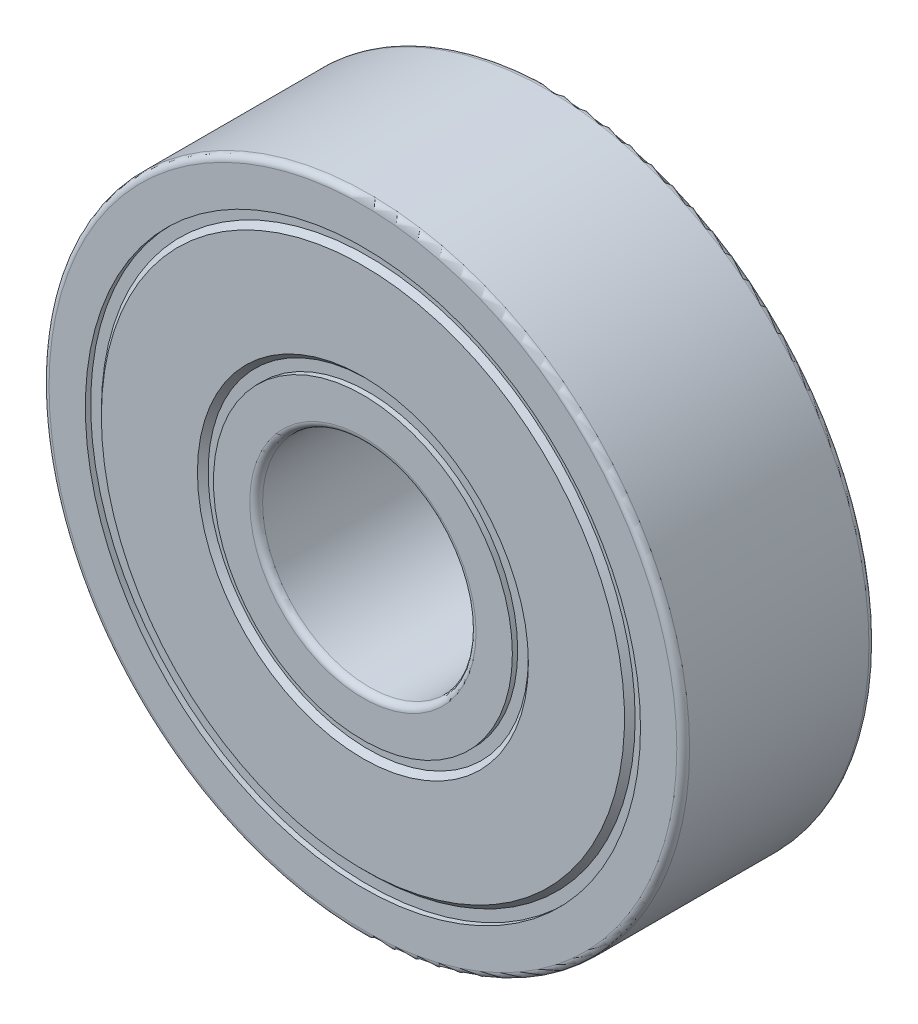
ISO-10303-21;
HEADER;
FILE_DESCRIPTION(('STEP AP214'),'2;1');
FILE_NAME('part.step','',(''),(''),'','','');
FILE_SCHEMA(('AUTOMOTIVE_DESIGN { 1 0 10303 214 1 1 1 1 }'));
ENDSEC;
DATA;
#1=APPLICATION_CONTEXT('core data for automotive mechanical design processes');
#2=APPLICATION_PROTOCOL_DEFINITION('international standard','automotive_design',2000,#1);
#3=PRODUCT_CONTEXT('',#1,'mechanical');
#4=PRODUCT('Part','Part','',(#3));
#5=PRODUCT_RELATED_PRODUCT_CATEGORY('part','',(#4));
#6=PRODUCT_DEFINITION_FORMATION('','',#4);
#7=PRODUCT_DEFINITION_CONTEXT('part definition',#1,'design');
#8=PRODUCT_DEFINITION('design','',#6,#7);
#9=PRODUCT_DEFINITION_SHAPE('','',#8);
#10=(LENGTH_UNIT() NAMED_UNIT(*) SI_UNIT(.MILLI.,.METRE.));
#11=(NAMED_UNIT(*) PLANE_ANGLE_UNIT() SI_UNIT($,.RADIAN.));
#12=(NAMED_UNIT(*) SI_UNIT($,.STERADIAN.) SOLID_ANGLE_UNIT());
#13=UNCERTAINTY_MEASURE_WITH_UNIT(LENGTH_MEASURE(1.E-05),#10,'distance_accuracy_value','');
#14=(GEOMETRIC_REPRESENTATION_CONTEXT(3) GLOBAL_UNCERTAINTY_ASSIGNED_CONTEXT((#13)) GLOBAL_UNIT_ASSIGNED_CONTEXT((#10,
#11,#12)) REPRESENTATION_CONTEXT('',''));
#15=CARTESIAN_POINT('',(0.,0.,0.));
#16=DIRECTION('',(0.,0.,1.));
#17=DIRECTION('',(1.,0.,0.));
#18=AXIS2_PLACEMENT_3D('',#15,#16,#17);
#19=CARTESIAN_POINT('',(0.,0.,0.));
#20=DIRECTION('',(0.,0.,1.));
#21=DIRECTION('',(1.,0.,0.));
#22=AXIS2_PLACEMENT_3D('',#19,#20,#21);
#23=CYLINDRICAL_SURFACE('',#22,4.99999999999999);
#24=CARTESIAN_POINT('',(0.,0.,-4.20000000000002));
#25=DIRECTION('',(0.,0.,1.));
#26=DIRECTION('',(1.,0.,0.));
#27=AXIS2_PLACEMENT_3D('',#24,#25,#26);
#28=CIRCLE('',#27,5.00000000000001);
#29=CARTESIAN_POINT('',(5.00000000000001,0.,-4.20000000000002));
#30=VERTEX_POINT('',#29);
#31=EDGE_CURVE('E64',#30,#30,#28,.T.);
#32=ORIENTED_EDGE('',*,*,#31,.F.);
#33=EDGE_LOOP('',(#32));
#34=FACE_BOUND('',#33,.T.);
#35=CARTESIAN_POINT('',(0.,0.,4.20000000000001));
#36=DIRECTION('',(0.,0.,1.));
#37=DIRECTION('',(1.,0.,0.));
#38=AXIS2_PLACEMENT_3D('',#35,#36,#37);
#39=CIRCLE('',#38,5.00000000000001);
#40=CARTESIAN_POINT('',(5.00000000000001,0.,4.20000000000002));
#41=VERTEX_POINT('',#40);
#42=EDGE_CURVE('E490',#41,#41,#39,.F.);
#43=ORIENTED_EDGE('',*,*,#42,.F.);
#44=EDGE_LOOP('',(#43));
#45=FACE_BOUND('',#44,.T.);
#46=ADVANCED_FACE('F17',(#34,#45),#23,.F.);
#47=CARTESIAN_POINT('',(0.,0.,4.20000000000002));
#48=DIRECTION('',(0.,0.,1.));
#49=DIRECTION('',(1.,0.,0.));
#50=AXIS2_PLACEMENT_3D('',#47,#48,#49);
#51=TOROIDAL_SURFACE('',#50,5.30000000000001,0.299999999999999);
#52=CARTESIAN_POINT('',(0.,0.,4.50000000000001));
#53=DIRECTION('',(0.,0.,1.));
#54=DIRECTION('',(1.,0.,0.));
#55=AXIS2_PLACEMENT_3D('',#52,#53,#54);
#56=CIRCLE('',#55,5.29999999999999);
#57=CARTESIAN_POINT('',(-5.30000000000001,0.,4.50000000000001));
#58=VERTEX_POINT('',#57);
#59=CARTESIAN_POINT('',(5.29999999999999,0.,4.50000000000001));
#60=VERTEX_POINT('',#59);
#61=EDGE_CURVE('E58',#58,#60,#56,.F.);
#62=ORIENTED_EDGE('',*,*,#61,.F.);
#63=CARTESIAN_POINT('',(0.,0.,4.50000000000001));
#64=DIRECTION('',(0.,0.,1.));
#65=DIRECTION('',(-1.,0.,0.));
#66=AXIS2_PLACEMENT_3D('',#63,#64,#65);
#67=CIRCLE('',#66,5.30000000000001);
#68=EDGE_CURVE('E55',#60,#58,#67,.F.);
#69=ORIENTED_EDGE('',*,*,#68,.F.);
#70=EDGE_LOOP('',(#62,#69));
#71=FACE_BOUND('',#70,.T.);
#72=ORIENTED_EDGE('',*,*,#42,.T.);
#73=EDGE_LOOP('',(#72));
#74=FACE_BOUND('',#73,.T.);
#75=ADVANCED_FACE('F60',(#71,#74),#51,.T.);
#76=CARTESIAN_POINT('',(0.,0.,-4.20000000000002));
#77=DIRECTION('',(0.,0.,1.));
#78=DIRECTION('',(1.,0.,0.));
#79=AXIS2_PLACEMENT_3D('',#76,#77,#78);
#80=TOROIDAL_SURFACE('',#79,5.30000000000001,0.299999999999999);
#81=ORIENTED_EDGE('',*,*,#31,.T.);
#82=EDGE_LOOP('',(#81));
#83=FACE_BOUND('',#82,.T.);
#84=CARTESIAN_POINT('',(0.,0.,-4.50000000000001));
#85=DIRECTION('',(0.,0.,-1.));
#86=DIRECTION('',(1.,0.,0.));
#87=AXIS2_PLACEMENT_3D('',#84,#85,#86);
#88=CIRCLE('',#87,5.30000000000001);
#89=CARTESIAN_POINT('',(-5.29999999999999,0.,-4.50000000000001));
#90=VERTEX_POINT('',#89);
#91=CARTESIAN_POINT('',(5.3,0.,-4.50000000000001));
#92=VERTEX_POINT('',#91);
#93=EDGE_CURVE('E70',#90,#92,#88,.F.);
#94=ORIENTED_EDGE('',*,*,#93,.F.);
#95=CARTESIAN_POINT('',(0.,0.,-4.50000000000001));
#96=DIRECTION('',(0.,0.,-1.));
#97=DIRECTION('',(-1.,0.,0.));
#98=AXIS2_PLACEMENT_3D('',#95,#96,#97);
#99=CIRCLE('',#98,5.29999999999999);
#100=EDGE_CURVE('E118',#92,#90,#99,.F.);
#101=ORIENTED_EDGE('',*,*,#100,.F.);
#102=EDGE_LOOP('',(#94,#101));
#103=FACE_BOUND('',#102,.T.);
#104=ADVANCED_FACE('F91',(#83,#103),#80,.T.);
#105=CARTESIAN_POINT('',(4.99999999999999,0.,4.50000000000001));
#106=DIRECTION('',(0.,0.,1.));
#107=DIRECTION('',(1.,0.,0.));
#108=AXIS2_PLACEMENT_3D('',#105,#106,#107);
#109=PLANE('',#108);
#110=ORIENTED_EDGE('',*,*,#61,.T.);
#111=ORIENTED_EDGE('',*,*,#68,.T.);
#112=EDGE_LOOP('',(#110,#111));
#113=FACE_BOUND('',#112,.T.);
#114=CARTESIAN_POINT('',(0.,0.,4.50000000000001));
#115=DIRECTION('',(0.,0.,1.));
#116=DIRECTION('',(1.,0.,0.));
#117=AXIS2_PLACEMENT_3D('',#114,#115,#116);
#118=CIRCLE('',#117,6.99999999999999);
#119=CARTESIAN_POINT('',(6.99999999999999,0.,4.50000000000001));
#120=VERTEX_POINT('',#119);
#121=EDGE_CURVE('E20',#120,#120,#118,.F.);
#122=ORIENTED_EDGE('',*,*,#121,.F.);
#123=EDGE_LOOP('',(#122));
#124=FACE_BOUND('',#123,.T.);
#125=ADVANCED_FACE('F68',(#113,#124),#109,.T.);
#126=CARTESIAN_POINT('',(6.99999999999999,0.,-4.50000000000001));
#127=DIRECTION('',(0.,0.,-1.));
#128=DIRECTION('',(-1.,0.,0.));
#129=AXIS2_PLACEMENT_3D('',#126,#127,#128);
#130=PLANE('',#129);
#131=ORIENTED_EDGE('',*,*,#93,.T.);
#132=ORIENTED_EDGE('',*,*,#100,.T.);
#133=EDGE_LOOP('',(#131,#132));
#134=FACE_BOUND('',#133,.T.);
#135=CARTESIAN_POINT('',(0.,0.,-4.50000000000001));
#136=DIRECTION('',(0.,0.,1.));
#137=DIRECTION('',(1.,0.,0.));
#138=AXIS2_PLACEMENT_3D('',#135,#136,#137);
#139=CIRCLE('',#138,6.99999999999999);
#140=CARTESIAN_POINT('',(6.99999999999999,0.,-4.50000000000001));
#141=VERTEX_POINT('',#140);
#142=EDGE_CURVE('E291',#141,#141,#139,.T.);
#143=ORIENTED_EDGE('',*,*,#142,.F.);
#144=EDGE_LOOP('',(#143));
#145=FACE_BOUND('',#144,.T.);
#146=ADVANCED_FACE('F90',(#134,#145),#130,.T.);
#147=CARTESIAN_POINT('',(0.,0.,4.375));
#148=DIRECTION('',(0.,0.,1.));
#149=DIRECTION('',(1.,0.,0.));
#150=AXIS2_PLACEMENT_3D('',#147,#148,#149);
#151=CYLINDRICAL_SURFACE('',#150,6.99999999999999);
#152=CARTESIAN_POINT('',(0.,0.,4.25000000000002));
#153=DIRECTION('',(0.,0.,1.));
#154=DIRECTION('',(1.,0.,0.));
#155=AXIS2_PLACEMENT_3D('',#152,#153,#154);
#156=CIRCLE('',#155,6.99999999999999);
#157=CARTESIAN_POINT('',(6.99999999999999,0.,4.25000000000002));
#158=VERTEX_POINT('',#157);
#159=EDGE_CURVE('E289',#158,#158,#156,.F.);
#160=ORIENTED_EDGE('',*,*,#159,.F.);
#161=EDGE_LOOP('',(#160));
#162=FACE_BOUND('',#161,.T.);
#163=ORIENTED_EDGE('',*,*,#121,.T.);
#164=EDGE_LOOP('',(#163));
#165=FACE_BOUND('',#164,.T.);
#166=ADVANCED_FACE('F298',(#162,#165),#151,.T.);
#167=CARTESIAN_POINT('',(0.,0.,-4.375));
#168=DIRECTION('',(0.,0.,1.));
#169=DIRECTION('',(1.,0.,0.));
#170=AXIS2_PLACEMENT_3D('',#167,#168,#169);
#171=CYLINDRICAL_SURFACE('',#170,6.99999999999999);
#172=ORIENTED_EDGE('',*,*,#142,.T.);
#173=EDGE_LOOP('',(#172));
#174=FACE_BOUND('',#173,.T.);
#175=CARTESIAN_POINT('',(0.,0.,-4.25000000000002));
#176=DIRECTION('',(0.,0.,1.));
#177=DIRECTION('',(1.,0.,0.));
#178=AXIS2_PLACEMENT_3D('',#175,#176,#177);
#179=CIRCLE('',#178,6.99999999999999);
#180=CARTESIAN_POINT('',(6.99999999999999,0.,-4.25000000000002));
#181=VERTEX_POINT('',#180);
#182=EDGE_CURVE('E286',#181,#181,#179,.T.);
#183=ORIENTED_EDGE('',*,*,#182,.F.);
#184=EDGE_LOOP('',(#183));
#185=FACE_BOUND('',#184,.T.);
#186=ADVANCED_FACE('F300',(#174,#185),#171,.T.);
#187=CARTESIAN_POINT('',(6.99999999999999,0.,4.25000000000002));
#188=DIRECTION('',(0.,0.,1.));
#189=DIRECTION('',(1.,0.,0.));
#190=AXIS2_PLACEMENT_3D('',#187,#188,#189);
#191=PLANE('',#190);
#192=ORIENTED_EDGE('',*,*,#159,.T.);
#193=EDGE_LOOP('',(#192));
#194=FACE_BOUND('',#193,.T.);
#195=CARTESIAN_POINT('',(0.,0.,4.25000000000001));
#196=DIRECTION('',(0.,0.,1.));
#197=DIRECTION('',(1.,0.,0.));
#198=AXIS2_PLACEMENT_3D('',#195,#196,#197);
#199=CIRCLE('',#198,7.50000000000001);
#200=CARTESIAN_POINT('',(7.50000000000001,0.,4.25000000000001));
#201=VERTEX_POINT('',#200);
#202=EDGE_CURVE('E283',#201,#201,#199,.T.);
#203=ORIENTED_EDGE('',*,*,#202,.T.);
#204=EDGE_LOOP('',(#203));
#205=FACE_BOUND('',#204,.T.);
#206=ADVANCED_FACE('F307',(#194,#205),#191,.T.);
#207=CARTESIAN_POINT('',(7.5,0.,-4.25000000000002));
#208=DIRECTION('',(0.,0.,-1.));
#209=DIRECTION('',(-1.,0.,0.));
#210=AXIS2_PLACEMENT_3D('',#207,#208,#209);
#211=PLANE('',#210);
#212=ORIENTED_EDGE('',*,*,#182,.T.);
#213=EDGE_LOOP('',(#212));
#214=FACE_BOUND('',#213,.T.);
#215=CARTESIAN_POINT('',(0.,0.,-4.25000000000001));
#216=DIRECTION('',(0.,0.,-1.));
#217=DIRECTION('',(-1.,0.,0.));
#218=AXIS2_PLACEMENT_3D('',#215,#216,#217);
#219=CIRCLE('',#218,7.50000000000001);
#220=CARTESIAN_POINT('',(-7.50000000000001,0.,-4.25000000000001));
#221=VERTEX_POINT('',#220);
#222=EDGE_CURVE('E280',#221,#221,#219,.T.);
#223=ORIENTED_EDGE('',*,*,#222,.T.);
#224=EDGE_LOOP('',(#223));
#225=FACE_BOUND('',#224,.T.);
#226=ADVANCED_FACE('F418',(#214,#225),#211,.T.);
#227=CARTESIAN_POINT('',(0.,0.,4.5));
#228=DIRECTION('',(0.,0.,1.));
#229=DIRECTION('',(1.,0.,0.));
#230=AXIS2_PLACEMENT_3D('',#227,#228,#229);
#231=CONICAL_SURFACE('',#230,7.75000000000001,0.78539816339746);
#232=ORIENTED_EDGE('',*,*,#202,.F.);
#233=EDGE_LOOP('',(#232));
#234=FACE_BOUND('',#233,.T.);
#235=CARTESIAN_POINT('',(0.,0.,4.49999999999999));
#236=DIRECTION('',(0.,0.,1.));
#237=DIRECTION('',(1.,0.,0.));
#238=AXIS2_PLACEMENT_3D('',#235,#236,#237);
#239=CIRCLE('',#238,7.75);
#240=CARTESIAN_POINT('',(7.75,0.,4.49999999999999));
#241=VERTEX_POINT('',#240);
#242=EDGE_CURVE('E277',#241,#241,#239,.F.);
#243=ORIENTED_EDGE('',*,*,#242,.F.);
#244=EDGE_LOOP('',(#243));
#245=FACE_BOUND('',#244,.T.);
#246=ADVANCED_FACE('F410',(#234,#245),#231,.F.);
#247=CARTESIAN_POINT('',(0.,0.,-4.5));
#248=DIRECTION('',(0.,0.,-1.));
#249=DIRECTION('',(-1.,0.,0.));
#250=AXIS2_PLACEMENT_3D('',#247,#248,#249);
#251=CONICAL_SURFACE('',#250,7.75,0.785398163397455);
#252=CARTESIAN_POINT('',(0.,0.,-4.5));
#253=DIRECTION('',(0.,0.,-1.));
#254=DIRECTION('',(-1.,0.,0.));
#255=AXIS2_PLACEMENT_3D('',#252,#253,#254);
#256=CIRCLE('',#255,7.75);
#257=CARTESIAN_POINT('',(-7.75,0.,-4.5));
#258=VERTEX_POINT('',#257);
#259=EDGE_CURVE('E274',#258,#258,#256,.F.);
#260=ORIENTED_EDGE('',*,*,#259,.F.);
#261=EDGE_LOOP('',(#260));
#262=FACE_BOUND('',#261,.T.);
#263=ORIENTED_EDGE('',*,*,#222,.F.);
#264=EDGE_LOOP('',(#263));
#265=FACE_BOUND('',#264,.T.);
#266=ADVANCED_FACE('F402',(#262,#265),#251,.F.);
#267=CARTESIAN_POINT('',(7.74999999999999,0.,4.50000000000001));
#268=DIRECTION('',(0.,0.,1.));
#269=DIRECTION('',(1.,0.,0.));
#270=AXIS2_PLACEMENT_3D('',#267,#268,#269);
#271=PLANE('',#270);
#272=ORIENTED_EDGE('',*,*,#242,.T.);
#273=EDGE_LOOP('',(#272));
#274=FACE_BOUND('',#273,.T.);
#275=CARTESIAN_POINT('',(0.,0.,4.50000000000001));
#276=DIRECTION('',(0.,0.,-1.));
#277=DIRECTION('',(-1.,0.,0.));
#278=AXIS2_PLACEMENT_3D('',#275,#276,#277);
#279=CIRCLE('',#278,12.25);
#280=CARTESIAN_POINT('',(-12.25,0.,4.5));
#281=VERTEX_POINT('',#280);
#282=EDGE_CURVE('E271',#281,#281,#279,.T.);
#283=ORIENTED_EDGE('',*,*,#282,.F.);
#284=EDGE_LOOP('',(#283));
#285=FACE_BOUND('',#284,.T.);
#286=ADVANCED_FACE('F394',(#274,#285),#271,.T.);
#287=CARTESIAN_POINT('',(12.25,0.,-4.50000000000001));
#288=DIRECTION('',(0.,0.,-1.));
#289=DIRECTION('',(-1.,0.,0.));
#290=AXIS2_PLACEMENT_3D('',#287,#288,#289);
#291=PLANE('',#290);
#292=ORIENTED_EDGE('',*,*,#259,.T.);
#293=EDGE_LOOP('',(#292));
#294=FACE_BOUND('',#293,.T.);
#295=CARTESIAN_POINT('',(0.,0.,-4.50000000000001));
#296=DIRECTION('',(0.,0.,1.));
#297=DIRECTION('',(1.,0.,0.));
#298=AXIS2_PLACEMENT_3D('',#295,#296,#297);
#299=CIRCLE('',#298,12.25);
#300=CARTESIAN_POINT('',(12.25,0.,-4.50000000000001));
#301=VERTEX_POINT('',#300);
#302=EDGE_CURVE('E268',#301,#301,#299,.T.);
#303=ORIENTED_EDGE('',*,*,#302,.F.);
#304=EDGE_LOOP('',(#303));
#305=FACE_BOUND('',#304,.T.);
#306=ADVANCED_FACE('F386',(#294,#305),#291,.T.);
#307=CARTESIAN_POINT('',(0.,0.,4.25));
#308=DIRECTION('',(0.,0.,-1.));
#309=DIRECTION('',(-1.,0.,0.));
#310=AXIS2_PLACEMENT_3D('',#307,#308,#309);
#311=CONICAL_SURFACE('',#310,12.5,0.785398163397438);
#312=CARTESIAN_POINT('',(0.,0.,4.25));
#313=DIRECTION('',(0.,0.,-1.));
#314=DIRECTION('',(-1.,0.,0.));
#315=AXIS2_PLACEMENT_3D('',#312,#313,#314);
#316=CIRCLE('',#315,12.5);
#317=CARTESIAN_POINT('',(-12.5,0.,4.25));
#318=VERTEX_POINT('',#317);
#319=EDGE_CURVE('E265',#318,#318,#316,.T.);
#320=ORIENTED_EDGE('',*,*,#319,.F.);
#321=EDGE_LOOP('',(#320));
#322=FACE_BOUND('',#321,.T.);
#323=ORIENTED_EDGE('',*,*,#282,.T.);
#324=EDGE_LOOP('',(#323));
#325=FACE_BOUND('',#324,.T.);
#326=ADVANCED_FACE('F378',(#322,#325),#311,.T.);
#327=CARTESIAN_POINT('',(0.,0.,-4.25000000000002));
#328=DIRECTION('',(0.,0.,1.));
#329=DIRECTION('',(1.,0.,0.));
#330=AXIS2_PLACEMENT_3D('',#327,#328,#329);
#331=CONICAL_SURFACE('',#330,12.5,0.78539816339744);
#332=ORIENTED_EDGE('',*,*,#302,.T.);
#333=EDGE_LOOP('',(#332));
#334=FACE_BOUND('',#333,.T.);
#335=CARTESIAN_POINT('',(0.,0.,-4.25000000000002));
#336=DIRECTION('',(0.,0.,1.));
#337=DIRECTION('',(1.,0.,0.));
#338=AXIS2_PLACEMENT_3D('',#335,#336,#337);
#339=CIRCLE('',#338,12.5);
#340=CARTESIAN_POINT('',(12.5,0.,-4.25000000000002));
#341=VERTEX_POINT('',#340);
#342=EDGE_CURVE('E262',#341,#341,#339,.T.);
#343=ORIENTED_EDGE('',*,*,#342,.F.);
#344=EDGE_LOOP('',(#343));
#345=FACE_BOUND('',#344,.T.);
#346=ADVANCED_FACE('F370',(#334,#345),#331,.T.);
#347=CARTESIAN_POINT('',(12.5,0.,4.25000000000002));
#348=DIRECTION('',(0.,0.,1.));
#349=DIRECTION('',(1.,0.,0.));
#350=AXIS2_PLACEMENT_3D('',#347,#348,#349);
#351=PLANE('',#350);
#352=ORIENTED_EDGE('',*,*,#319,.T.);
#353=EDGE_LOOP('',(#352));
#354=FACE_BOUND('',#353,.T.);
#355=CARTESIAN_POINT('',(0.,0.,4.25000000000002));
#356=DIRECTION('',(0.,0.,1.));
#357=DIRECTION('',(1.,0.,0.));
#358=AXIS2_PLACEMENT_3D('',#355,#356,#357);
#359=CIRCLE('',#358,13.);
#360=CARTESIAN_POINT('',(13.,0.,4.25000000000002));
#361=VERTEX_POINT('',#360);
#362=EDGE_CURVE('E259',#361,#361,#359,.T.);
#363=ORIENTED_EDGE('',*,*,#362,.T.);
#364=EDGE_LOOP('',(#363));
#365=FACE_BOUND('',#364,.T.);
#366=ADVANCED_FACE('F362',(#354,#365),#351,.T.);
#367=CARTESIAN_POINT('',(13.,0.,-4.25000000000002));
#368=DIRECTION('',(0.,0.,-1.));
#369=DIRECTION('',(-1.,0.,0.));
#370=AXIS2_PLACEMENT_3D('',#367,#368,#369);
#371=PLANE('',#370);
#372=ORIENTED_EDGE('',*,*,#342,.T.);
#373=EDGE_LOOP('',(#372));
#374=FACE_BOUND('',#373,.T.);
#375=CARTESIAN_POINT('',(0.,0.,-4.25000000000002));
#376=DIRECTION('',(0.,0.,1.));
#377=DIRECTION('',(1.,0.,0.));
#378=AXIS2_PLACEMENT_3D('',#375,#376,#377);
#379=CIRCLE('',#378,13.);
#380=CARTESIAN_POINT('',(13.,0.,-4.25000000000002));
#381=VERTEX_POINT('',#380);
#382=EDGE_CURVE('E252',#381,#381,#379,.F.);
#383=ORIENTED_EDGE('',*,*,#382,.T.);
#384=EDGE_LOOP('',(#383));
#385=FACE_BOUND('',#384,.T.);
#386=ADVANCED_FACE('F355',(#374,#385),#371,.T.);
#387=CARTESIAN_POINT('',(0.,0.,4.375));
#388=DIRECTION('',(0.,0.,1.));
#389=DIRECTION('',(1.,0.,0.));
#390=AXIS2_PLACEMENT_3D('',#387,#388,#389);
#391=CYLINDRICAL_SURFACE('',#390,13.);
#392=ORIENTED_EDGE('',*,*,#362,.F.);
#393=EDGE_LOOP('',(#392));
#394=FACE_BOUND('',#393,.T.);
#395=CARTESIAN_POINT('',(0.,0.,4.50000000000001));
#396=DIRECTION('',(0.,0.,1.));
#397=DIRECTION('',(1.,0.,0.));
#398=AXIS2_PLACEMENT_3D('',#395,#396,#397);
#399=CIRCLE('',#398,13.);
#400=CARTESIAN_POINT('',(13.,0.,4.50000000000001));
#401=VERTEX_POINT('',#400);
#402=EDGE_CURVE('E247',#401,#401,#399,.F.);
#403=ORIENTED_EDGE('',*,*,#402,.F.);
#404=EDGE_LOOP('',(#403));
#405=FACE_BOUND('',#404,.T.);
#406=ADVANCED_FACE('F348',(#394,#405),#391,.F.);
#407=CARTESIAN_POINT('',(0.,0.,-4.37500000000003));
#408=DIRECTION('',(0.,0.,1.));
#409=DIRECTION('',(1.,0.,0.));
#410=AXIS2_PLACEMENT_3D('',#407,#408,#409);
#411=CYLINDRICAL_SURFACE('',#410,13.);
#412=CARTESIAN_POINT('',(0.,0.,-4.50000000000001));
#413=DIRECTION('',(0.,0.,1.));
#414=DIRECTION('',(1.,0.,0.));
#415=AXIS2_PLACEMENT_3D('',#412,#413,#414);
#416=CIRCLE('',#415,13.);
#417=CARTESIAN_POINT('',(13.,0.,-4.5));
#418=VERTEX_POINT('',#417);
#419=EDGE_CURVE('E245',#418,#418,#416,.T.);
#420=ORIENTED_EDGE('',*,*,#419,.F.);
#421=EDGE_LOOP('',(#420));
#422=FACE_BOUND('',#421,.T.);
#423=ORIENTED_EDGE('',*,*,#382,.F.);
#424=EDGE_LOOP('',(#423));
#425=FACE_BOUND('',#424,.T.);
#426=ADVANCED_FACE('F224',(#422,#425),#411,.F.);
#427=CARTESIAN_POINT('',(13.,0.,4.50000000000001));
#428=DIRECTION('',(0.,0.,1.));
#429=DIRECTION('',(1.,0.,0.));
#430=AXIS2_PLACEMENT_3D('',#427,#428,#429);
#431=PLANE('',#430);
#432=ORIENTED_EDGE('',*,*,#402,.T.);
#433=EDGE_LOOP('',(#432));
#434=FACE_BOUND('',#433,.T.);
#435=CARTESIAN_POINT('',(0.,0.,4.50000000000001));
#436=DIRECTION('',(0.,0.,-1.));
#437=DIRECTION('',(1.,0.,0.));
#438=AXIS2_PLACEMENT_3D('',#435,#436,#437);
#439=CIRCLE('',#438,14.7);
#440=CARTESIAN_POINT('',(14.7,0.,4.50000000000001));
#441=VERTEX_POINT('',#440);
#442=CARTESIAN_POINT('',(-14.7,0.,4.50000000000001));
#443=VERTEX_POINT('',#442);
#444=EDGE_CURVE('E210',#441,#443,#439,.T.);
#445=ORIENTED_EDGE('',*,*,#444,.F.);
#446=CARTESIAN_POINT('',(0.,0.,4.50000000000001));
#447=DIRECTION('',(0.,0.,-1.));
#448=DIRECTION('',(-1.,0.,0.));
#449=AXIS2_PLACEMENT_3D('',#446,#447,#448);
#450=CIRCLE('',#449,14.7);
#451=EDGE_CURVE('E244',#443,#441,#450,.T.);
#452=ORIENTED_EDGE('',*,*,#451,.F.);
#453=EDGE_LOOP('',(#445,#452));
#454=FACE_BOUND('',#453,.T.);
#455=ADVANCED_FACE('F215',(#434,#454),#431,.T.);
#456=CARTESIAN_POINT('',(15.,0.,-4.50000000000001));
#457=DIRECTION('',(0.,0.,-1.));
#458=DIRECTION('',(-1.,0.,0.));
#459=AXIS2_PLACEMENT_3D('',#456,#457,#458);
#460=PLANE('',#459);
#461=ORIENTED_EDGE('',*,*,#419,.T.);
#462=EDGE_LOOP('',(#461));
#463=FACE_BOUND('',#462,.T.);
#464=CARTESIAN_POINT('',(0.,0.,-4.50000000000001));
#465=DIRECTION('',(0.,0.,1.));
#466=DIRECTION('',(1.,0.,0.));
#467=AXIS2_PLACEMENT_3D('',#464,#465,#466);
#468=CIRCLE('',#467,14.7);
#469=CARTESIAN_POINT('',(14.7,0.,-4.50000000000001));
#470=VERTEX_POINT('',#469);
#471=CARTESIAN_POINT('',(-14.7,0.,-4.50000000000002));
#472=VERTEX_POINT('',#471);
#473=EDGE_CURVE('E34',#470,#472,#468,.T.);
#474=ORIENTED_EDGE('',*,*,#473,.F.);
#475=CARTESIAN_POINT('',(0.,0.,-4.50000000000001));
#476=DIRECTION('',(0.,0.,1.));
#477=DIRECTION('',(-1.,0.,0.));
#478=AXIS2_PLACEMENT_3D('',#475,#476,#477);
#479=CIRCLE('',#478,14.7);
#480=EDGE_CURVE('E179',#472,#470,#479,.T.);
#481=ORIENTED_EDGE('',*,*,#480,.F.);
#482=EDGE_LOOP('',(#474,#481));
#483=FACE_BOUND('',#482,.T.);
#484=ADVANCED_FACE('F158',(#463,#483),#460,.T.);
#485=CARTESIAN_POINT('',(0.,0.,4.20000000000002));
#486=DIRECTION('',(0.,0.,1.));
#487=DIRECTION('',(1.,0.,0.));
#488=AXIS2_PLACEMENT_3D('',#485,#486,#487);
#489=TOROIDAL_SURFACE('',#488,14.7,0.299999999999999);
#490=CARTESIAN_POINT('',(0.,0.,4.20000000000002));
#491=DIRECTION('',(0.,0.,1.));
#492=DIRECTION('',(1.,0.,0.));
#493=AXIS2_PLACEMENT_3D('',#490,#491,#492);
#494=CIRCLE('',#493,15.);
#495=CARTESIAN_POINT('',(15.,0.,4.20000000000002));
#496=VERTEX_POINT('',#495);
#497=EDGE_CURVE('E26',#496,#496,#494,.F.);
#498=ORIENTED_EDGE('',*,*,#497,.F.);
#499=EDGE_LOOP('',(#498));
#500=FACE_BOUND('',#499,.T.);
#501=ORIENTED_EDGE('',*,*,#444,.T.);
#502=ORIENTED_EDGE('',*,*,#451,.T.);
#503=EDGE_LOOP('',(#501,#502));
#504=FACE_BOUND('',#503,.T.);
#505=ADVANCED_FACE('F146',(#500,#504),#489,.T.);
#506=CARTESIAN_POINT('',(0.,0.,-4.20000000000002));
#507=DIRECTION('',(0.,0.,1.));
#508=DIRECTION('',(1.,0.,0.));
#509=AXIS2_PLACEMENT_3D('',#506,#507,#508);
#510=TOROIDAL_SURFACE('',#509,14.7,0.299999999999999);
#511=ORIENTED_EDGE('',*,*,#473,.T.);
#512=ORIENTED_EDGE('',*,*,#480,.T.);
#513=EDGE_LOOP('',(#511,#512));
#514=FACE_BOUND('',#513,.T.);
#515=CARTESIAN_POINT('',(0.,0.,-4.20000000000001));
#516=DIRECTION('',(0.,0.,1.));
#517=DIRECTION('',(1.,0.,0.));
#518=AXIS2_PLACEMENT_3D('',#515,#516,#517);
#519=CIRCLE('',#518,15.);
#520=CARTESIAN_POINT('',(15.,0.,-4.20000000000001));
#521=VERTEX_POINT('',#520);
#522=EDGE_CURVE('E11',#521,#521,#519,.T.);
#523=ORIENTED_EDGE('',*,*,#522,.F.);
#524=EDGE_LOOP('',(#523));
#525=FACE_BOUND('',#524,.T.);
#526=ADVANCED_FACE('F157',(#514,#525),#510,.T.);
#527=CARTESIAN_POINT('',(0.,0.,0.));
#528=DIRECTION('',(0.,0.,1.));
#529=DIRECTION('',(1.,0.,0.));
#530=AXIS2_PLACEMENT_3D('',#527,#528,#529);
#531=CYLINDRICAL_SURFACE('',#530,15.);
#532=ORIENTED_EDGE('',*,*,#522,.T.);
#533=EDGE_LOOP('',(#532));
#534=FACE_BOUND('',#533,.T.);
#535=ORIENTED_EDGE('',*,*,#497,.T.);
#536=EDGE_LOOP('',(#535));
#537=FACE_BOUND('',#536,.T.);
#538=ADVANCED_FACE('F310',(#534,#537),#531,.T.);
#539=CLOSED_SHELL('',(#46,#75,#104,#125,#146,#166,#186,#206,#226,#246,#266,#286,#306,#326,#346,
#366,#386,#406,#426,#455,#484,#505,#526,#538));
#540=MANIFOLD_SOLID_BREP('B1',#539);
#541=ADVANCED_BREP_SHAPE_REPRESENTATION('',(#18,#540),#14);
#542=SHAPE_DEFINITION_REPRESENTATION(#9,#541);
ENDSEC;
END-ISO-10303-21;
